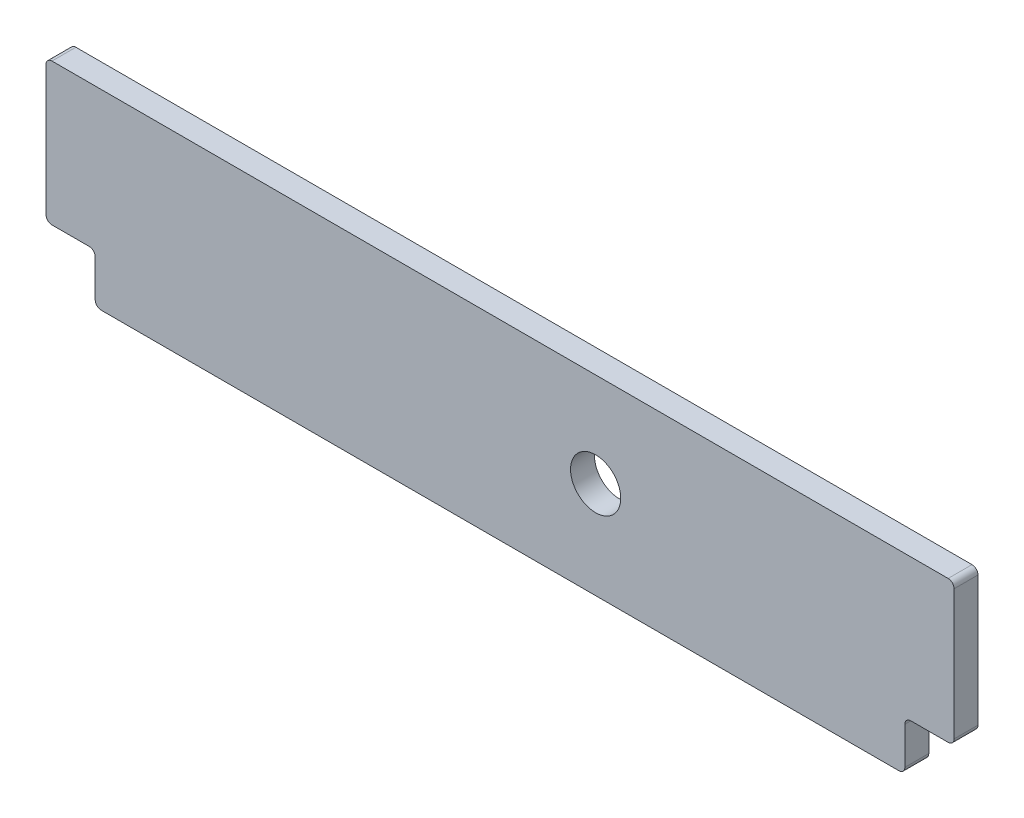
ISO-10303-21;
HEADER;
FILE_DESCRIPTION(('STEP AP214'),'2;1');
FILE_NAME('part.step','',(''),(''),'','','');
FILE_SCHEMA(('AUTOMOTIVE_DESIGN { 1 0 10303 214 1 1 1 1 }'));
ENDSEC;
DATA;
#1=APPLICATION_CONTEXT('core data for automotive mechanical design processes');
#2=APPLICATION_PROTOCOL_DEFINITION('international standard','automotive_design',2000,#1);
#3=PRODUCT_CONTEXT('',#1,'mechanical');
#4=PRODUCT('Part','Part','',(#3));
#5=PRODUCT_RELATED_PRODUCT_CATEGORY('part','',(#4));
#6=PRODUCT_DEFINITION_FORMATION('','',#4);
#7=PRODUCT_DEFINITION_CONTEXT('part definition',#1,'design');
#8=PRODUCT_DEFINITION('design','',#6,#7);
#9=PRODUCT_DEFINITION_SHAPE('','',#8);
#10=(LENGTH_UNIT() NAMED_UNIT(*) SI_UNIT(.MILLI.,.METRE.));
#11=(NAMED_UNIT(*) PLANE_ANGLE_UNIT() SI_UNIT($,.RADIAN.));
#12=(NAMED_UNIT(*) SI_UNIT($,.STERADIAN.) SOLID_ANGLE_UNIT());
#13=UNCERTAINTY_MEASURE_WITH_UNIT(LENGTH_MEASURE(1.E-05),#10,'distance_accuracy_value','');
#14=(GEOMETRIC_REPRESENTATION_CONTEXT(3) GLOBAL_UNCERTAINTY_ASSIGNED_CONTEXT((#13)) GLOBAL_UNIT_ASSIGNED_CONTEXT((#10,
#11,#12)) REPRESENTATION_CONTEXT('',''));
#15=CARTESIAN_POINT('',(0.,0.,0.));
#16=DIRECTION('',(0.,0.,1.));
#17=DIRECTION('',(1.,0.,0.));
#18=AXIS2_PLACEMENT_3D('',#15,#16,#17);
#19=CARTESIAN_POINT('',(215.138,0.,6.35));
#20=DIRECTION('',(-1.,0.,0.));
#21=DIRECTION('',(0.,-1.,0.));
#22=AXIS2_PLACEMENT_3D('',#19,#20,#21);
#23=PLANE('',#22);
#24=DIRECTION('',(0.,1.,0.));
#25=VECTOR('',#24,1.);
#26=CARTESIAN_POINT('',(215.138,2.35089725464378E-13,6.35));
#27=LINE('',#26,#25);
#28=CARTESIAN_POINT('',(215.138,3.17500000000005,6.35));
#29=VERTEX_POINT('',#28);
#30=CARTESIAN_POINT('',(215.138,22.9869999999999,6.35));
#31=VERTEX_POINT('',#30);
#32=EDGE_CURVE('E181',#29,#31,#27,.T.);
#33=ORIENTED_EDGE('',*,*,#32,.F.);
#34=DIRECTION('',(0.,0.,-1.));
#35=VECTOR('',#34,1.);
#36=CARTESIAN_POINT('',(215.138,3.17500000000005,6.35));
#37=LINE('',#36,#35);
#38=CARTESIAN_POINT('',(215.138,3.17500000000005,-6.35));
#39=VERTEX_POINT('',#38);
#40=EDGE_CURVE('E165',#29,#39,#37,.T.);
#41=ORIENTED_EDGE('',*,*,#40,.T.);
#42=DIRECTION('',(0.,1.,0.));
#43=VECTOR('',#42,1.);
#44=CARTESIAN_POINT('',(215.138,2.35089725464378E-13,-6.35));
#45=LINE('',#44,#43);
#46=CARTESIAN_POINT('',(215.138,22.9869999999999,-6.35));
#47=VERTEX_POINT('',#46);
#48=EDGE_CURVE('E178',#39,#47,#45,.T.);
#49=ORIENTED_EDGE('',*,*,#48,.T.);
#50=DIRECTION('',(0.,0.,-1.));
#51=VECTOR('',#50,1.);
#52=CARTESIAN_POINT('',(215.138,22.9869999999999,6.35));
#53=LINE('',#52,#51);
#54=EDGE_CURVE('E184',#47,#31,#53,.F.);
#55=ORIENTED_EDGE('',*,*,#54,.T.);
#56=EDGE_LOOP('',(#33,#41,#49,#55));
#57=FACE_BOUND('',#56,.T.);
#58=ADVANCED_FACE('F44',(#57),#23,.F.);
#59=CARTESIAN_POINT('',(215.9,26.1619999999999,6.35));
#60=DIRECTION('',(0.,1.,0.));
#61=DIRECTION('',(-1.,0.,0.));
#62=AXIS2_PLACEMENT_3D('',#59,#60,#61);
#63=PLANE('',#62);
#64=DIRECTION('',(1.,0.,0.));
#65=VECTOR('',#64,1.);
#66=CARTESIAN_POINT('',(0.,26.162,-6.35));
#67=LINE('',#66,#65);
#68=CARTESIAN_POINT('',(218.313,26.1619999999999,-6.35));
#69=VERTEX_POINT('',#68);
#70=CARTESIAN_POINT('',(238.125,26.1619999999999,-6.35));
#71=VERTEX_POINT('',#70);
#72=EDGE_CURVE('E189',#69,#71,#67,.T.);
#73=ORIENTED_EDGE('',*,*,#72,.T.);
#74=DIRECTION('',(0.,0.,-1.));
#75=VECTOR('',#74,1.);
#76=CARTESIAN_POINT('',(238.125,26.1619999999999,6.35));
#77=LINE('',#76,#75);
#78=CARTESIAN_POINT('',(238.125,26.1619999999999,6.35));
#79=VERTEX_POINT('',#78);
#80=EDGE_CURVE('E283',#71,#79,#77,.F.);
#81=ORIENTED_EDGE('',*,*,#80,.T.);
#82=DIRECTION('',(1.,0.,0.));
#83=VECTOR('',#82,1.);
#84=CARTESIAN_POINT('',(0.,26.162,6.35));
#85=LINE('',#84,#83);
#86=CARTESIAN_POINT('',(218.313,26.1619999999999,6.35));
#87=VERTEX_POINT('',#86);
#88=EDGE_CURVE('E201',#87,#79,#85,.T.);
#89=ORIENTED_EDGE('',*,*,#88,.F.);
#90=DIRECTION('',(0.,0.,-1.));
#91=VECTOR('',#90,1.);
#92=CARTESIAN_POINT('',(218.313,26.1619999999999,-6.35));
#93=LINE('',#92,#91);
#94=EDGE_CURVE('E279',#87,#69,#93,.T.);
#95=ORIENTED_EDGE('',*,*,#94,.T.);
#96=EDGE_LOOP('',(#73,#81,#89,#95));
#97=FACE_BOUND('',#96,.T.);
#98=ADVANCED_FACE('F389',(#97),#63,.F.);
#99=CARTESIAN_POINT('',(241.3,101.6,6.35));
#100=DIRECTION('',(-1.,0.,0.));
#101=DIRECTION('',(0.,-1.,0.));
#102=AXIS2_PLACEMENT_3D('',#99,#100,#101);
#103=PLANE('',#102);
#104=DIRECTION('',(0.,1.,0.));
#105=VECTOR('',#104,1.);
#106=CARTESIAN_POINT('',(241.3,101.6,-6.35));
#107=LINE('',#106,#105);
#108=CARTESIAN_POINT('',(241.3,29.3369999999999,-6.35));
#109=VERTEX_POINT('',#108);
#110=CARTESIAN_POINT('',(241.3,98.4249999999999,-6.35));
#111=VERTEX_POINT('',#110);
#112=EDGE_CURVE('E193',#109,#111,#107,.T.);
#113=ORIENTED_EDGE('',*,*,#112,.T.);
#114=DIRECTION('',(0.,0.,-1.));
#115=VECTOR('',#114,1.);
#116=CARTESIAN_POINT('',(241.3,98.4249999999999,6.35));
#117=LINE('',#116,#115);
#118=CARTESIAN_POINT('',(241.3,98.4249999999999,6.35));
#119=VERTEX_POINT('',#118);
#120=EDGE_CURVE('E276',#111,#119,#117,.F.);
#121=ORIENTED_EDGE('',*,*,#120,.T.);
#122=DIRECTION('',(0.,1.,0.));
#123=VECTOR('',#122,1.);
#124=CARTESIAN_POINT('',(241.3,101.6,6.35));
#125=LINE('',#124,#123);
#126=CARTESIAN_POINT('',(241.3,29.3369999999999,6.35));
#127=VERTEX_POINT('',#126);
#128=EDGE_CURVE('E205',#127,#119,#125,.T.);
#129=ORIENTED_EDGE('',*,*,#128,.F.);
#130=DIRECTION('',(0.,0.,-1.));
#131=VECTOR('',#130,1.);
#132=CARTESIAN_POINT('',(241.3,29.3369999999999,6.35));
#133=LINE('',#132,#131);
#134=EDGE_CURVE('E272',#127,#109,#133,.T.);
#135=ORIENTED_EDGE('',*,*,#134,.T.);
#136=EDGE_LOOP('',(#113,#121,#129,#135));
#137=FACE_BOUND('',#136,.T.);
#138=ADVANCED_FACE('F357',(#137),#103,.F.);
#139=CARTESIAN_POINT('',(-241.3,101.6,6.35));
#140=DIRECTION('',(0.,-1.,0.));
#141=DIRECTION('',(1.,0.,0.));
#142=AXIS2_PLACEMENT_3D('',#139,#140,#141);
#143=PLANE('',#142);
#144=DIRECTION('',(-1.,0.,0.));
#145=VECTOR('',#144,1.);
#146=CARTESIAN_POINT('',(-241.3,101.6,-6.35));
#147=LINE('',#146,#145);
#148=CARTESIAN_POINT('',(238.125,101.6,-6.35));
#149=VERTEX_POINT('',#148);
#150=CARTESIAN_POINT('',(-238.125,101.6,-6.35));
#151=VERTEX_POINT('',#150);
#152=EDGE_CURVE('E346',#149,#151,#147,.T.);
#153=ORIENTED_EDGE('',*,*,#152,.T.);
#154=DIRECTION('',(0.,0.,-1.));
#155=VECTOR('',#154,1.);
#156=CARTESIAN_POINT('',(-238.125,101.6,6.35));
#157=LINE('',#156,#155);
#158=CARTESIAN_POINT('',(-238.125,101.6,6.35));
#159=VERTEX_POINT('',#158);
#160=EDGE_CURVE('E269',#151,#159,#157,.F.);
#161=ORIENTED_EDGE('',*,*,#160,.T.);
#162=DIRECTION('',(-1.,0.,0.));
#163=VECTOR('',#162,1.);
#164=CARTESIAN_POINT('',(-241.3,101.6,6.35));
#165=LINE('',#164,#163);
#166=CARTESIAN_POINT('',(238.125,101.6,6.35));
#167=VERTEX_POINT('',#166);
#168=EDGE_CURVE('E314',#167,#159,#165,.T.);
#169=ORIENTED_EDGE('',*,*,#168,.F.);
#170=DIRECTION('',(0.,0.,-1.));
#171=VECTOR('',#170,1.);
#172=CARTESIAN_POINT('',(238.125,101.6,6.35));
#173=LINE('',#172,#171);
#174=EDGE_CURVE('E265',#167,#149,#173,.T.);
#175=ORIENTED_EDGE('',*,*,#174,.T.);
#176=EDGE_LOOP('',(#153,#161,#169,#175));
#177=FACE_BOUND('',#176,.T.);
#178=ADVANCED_FACE('F366',(#177),#143,.F.);
#179=CARTESIAN_POINT('',(-241.3,101.6,6.35));
#180=DIRECTION('',(1.,0.,0.));
#181=DIRECTION('',(0.,0.,-1.));
#182=AXIS2_PLACEMENT_3D('',#179,#180,#181);
#183=PLANE('',#182);
#184=DIRECTION('',(0.,-1.,0.));
#185=VECTOR('',#184,1.);
#186=CARTESIAN_POINT('',(-241.3,101.6,6.35));
#187=LINE('',#186,#185);
#188=CARTESIAN_POINT('',(-241.3,98.4250000000001,6.35));
#189=VERTEX_POINT('',#188);
#190=CARTESIAN_POINT('',(-241.3,29.3370000000001,6.35));
#191=VERTEX_POINT('',#190);
#192=EDGE_CURVE('E310',#189,#191,#187,.T.);
#193=ORIENTED_EDGE('',*,*,#192,.F.);
#194=DIRECTION('',(0.,0.,-1.));
#195=VECTOR('',#194,1.);
#196=CARTESIAN_POINT('',(-241.3,98.4250000000001,6.35));
#197=LINE('',#196,#195);
#198=CARTESIAN_POINT('',(-241.3,98.4250000000001,-6.35));
#199=VERTEX_POINT('',#198);
#200=EDGE_CURVE('E261',#189,#199,#197,.T.);
#201=ORIENTED_EDGE('',*,*,#200,.T.);
#202=DIRECTION('',(0.,-1.,0.));
#203=VECTOR('',#202,1.);
#204=CARTESIAN_POINT('',(-241.3,101.6,-6.35));
#205=LINE('',#204,#203);
#206=CARTESIAN_POINT('',(-241.3,29.3370000000001,-6.35));
#207=VERTEX_POINT('',#206);
#208=EDGE_CURVE('E325',#199,#207,#205,.T.);
#209=ORIENTED_EDGE('',*,*,#208,.T.);
#210=DIRECTION('',(0.,0.,-1.));
#211=VECTOR('',#210,1.);
#212=CARTESIAN_POINT('',(-241.3,29.337,6.35));
#213=LINE('',#212,#211);
#214=EDGE_CURVE('E258',#207,#191,#213,.F.);
#215=ORIENTED_EDGE('',*,*,#214,.T.);
#216=EDGE_LOOP('',(#193,#201,#209,#215));
#217=FACE_BOUND('',#216,.T.);
#218=ADVANCED_FACE('F372',(#217),#183,.F.);
#219=CARTESIAN_POINT('',(-215.9,26.162,6.35));
#220=DIRECTION('',(0.,1.,0.));
#221=DIRECTION('',(0.,0.,1.));
#222=AXIS2_PLACEMENT_3D('',#219,#220,#221);
#223=PLANE('',#222);
#224=DIRECTION('',(1.,0.,0.));
#225=VECTOR('',#224,1.);
#226=CARTESIAN_POINT('',(0.,26.162,-6.35));
#227=LINE('',#226,#225);
#228=CARTESIAN_POINT('',(-238.125,26.162,-6.35));
#229=VERTEX_POINT('',#228);
#230=CARTESIAN_POINT('',(-218.313,26.162,-6.35));
#231=VERTEX_POINT('',#230);
#232=EDGE_CURVE('E321',#229,#231,#227,.T.);
#233=ORIENTED_EDGE('',*,*,#232,.T.);
#234=DIRECTION('',(0.,0.,-1.));
#235=VECTOR('',#234,1.);
#236=CARTESIAN_POINT('',(-218.313,26.162,6.35));
#237=LINE('',#236,#235);
#238=CARTESIAN_POINT('',(-218.313,26.162,6.35));
#239=VERTEX_POINT('',#238);
#240=EDGE_CURVE('E255',#231,#239,#237,.F.);
#241=ORIENTED_EDGE('',*,*,#240,.T.);
#242=DIRECTION('',(1.,0.,0.));
#243=VECTOR('',#242,1.);
#244=CARTESIAN_POINT('',(0.,26.162,6.35));
#245=LINE('',#244,#243);
#246=CARTESIAN_POINT('',(-238.125,26.162,6.35));
#247=VERTEX_POINT('',#246);
#248=EDGE_CURVE('E306',#247,#239,#245,.T.);
#249=ORIENTED_EDGE('',*,*,#248,.F.);
#250=DIRECTION('',(0.,0.,-1.));
#251=VECTOR('',#250,1.);
#252=CARTESIAN_POINT('',(-238.125,26.162,6.35));
#253=LINE('',#252,#251);
#254=EDGE_CURVE('E251',#247,#229,#253,.T.);
#255=ORIENTED_EDGE('',*,*,#254,.T.);
#256=EDGE_LOOP('',(#233,#241,#249,#255));
#257=FACE_BOUND('',#256,.T.);
#258=ADVANCED_FACE('F377',(#257),#223,.F.);
#259=CARTESIAN_POINT('',(-215.138,25.4,6.35));
#260=DIRECTION('',(1.,0.,0.));
#261=DIRECTION('',(0.,0.,-1.));
#262=AXIS2_PLACEMENT_3D('',#259,#260,#261);
#263=PLANE('',#262);
#264=DIRECTION('',(0.,-1.,0.));
#265=VECTOR('',#264,1.);
#266=CARTESIAN_POINT('',(-215.138,0.,-6.35));
#267=LINE('',#266,#265);
#268=CARTESIAN_POINT('',(-215.138,22.987,-6.35));
#269=VERTEX_POINT('',#268);
#270=CARTESIAN_POINT('',(-215.138,3.17500000000004,-6.35));
#271=VERTEX_POINT('',#270);
#272=EDGE_CURVE('E197',#269,#271,#267,.T.);
#273=ORIENTED_EDGE('',*,*,#272,.T.);
#274=DIRECTION('',(0.,0.,-1.));
#275=VECTOR('',#274,1.);
#276=CARTESIAN_POINT('',(-215.138,3.17500000000004,6.35));
#277=LINE('',#276,#275);
#278=CARTESIAN_POINT('',(-215.138,3.17500000000004,6.35));
#279=VERTEX_POINT('',#278);
#280=EDGE_CURVE('E62',#271,#279,#277,.F.);
#281=ORIENTED_EDGE('',*,*,#280,.T.);
#282=DIRECTION('',(0.,-1.,0.));
#283=VECTOR('',#282,1.);
#284=CARTESIAN_POINT('',(-215.138,0.,6.35));
#285=LINE('',#284,#283);
#286=CARTESIAN_POINT('',(-215.138,22.987,6.35));
#287=VERTEX_POINT('',#286);
#288=EDGE_CURVE('E302',#287,#279,#285,.T.);
#289=ORIENTED_EDGE('',*,*,#288,.F.);
#290=DIRECTION('',(0.,0.,-1.));
#291=VECTOR('',#290,1.);
#292=CARTESIAN_POINT('',(-215.138,22.987,-6.35));
#293=LINE('',#292,#291);
#294=EDGE_CURVE('E245',#287,#269,#293,.T.);
#295=ORIENTED_EDGE('',*,*,#294,.T.);
#296=EDGE_LOOP('',(#273,#281,#289,#295));
#297=FACE_BOUND('',#296,.T.);
#298=ADVANCED_FACE('F337',(#297),#263,.F.);
#299=CARTESIAN_POINT('',(-215.9,0.,6.35));
#300=DIRECTION('',(0.,1.,0.));
#301=DIRECTION('',(0.,0.,1.));
#302=AXIS2_PLACEMENT_3D('',#299,#300,#301);
#303=PLANE('',#302);
#304=DIRECTION('',(1.,0.,0.));
#305=VECTOR('',#304,1.);
#306=CARTESIAN_POINT('',(-215.9,0.,-6.35));
#307=LINE('',#306,#305);
#308=CARTESIAN_POINT('',(-211.963,0.,-6.35));
#309=VERTEX_POINT('',#308);
#310=CARTESIAN_POINT('',(211.963,0.,-6.35));
#311=VERTEX_POINT('',#310);
#312=EDGE_CURVE('E202',#309,#311,#307,.T.);
#313=ORIENTED_EDGE('',*,*,#312,.T.);
#314=DIRECTION('',(0.,0.,-1.));
#315=VECTOR('',#314,1.);
#316=CARTESIAN_POINT('',(211.963,0.,6.35));
#317=LINE('',#316,#315);
#318=CARTESIAN_POINT('',(211.963,0.,6.35));
#319=VERTEX_POINT('',#318);
#320=EDGE_CURVE('E166',#311,#319,#317,.F.);
#321=ORIENTED_EDGE('',*,*,#320,.T.);
#322=DIRECTION('',(1.,0.,0.));
#323=VECTOR('',#322,1.);
#324=CARTESIAN_POINT('',(-215.9,0.,6.35));
#325=LINE('',#324,#323);
#326=CARTESIAN_POINT('',(-211.963,0.,6.35));
#327=VERTEX_POINT('',#326);
#328=EDGE_CURVE('E295',#327,#319,#325,.T.);
#329=ORIENTED_EDGE('',*,*,#328,.F.);
#330=DIRECTION('',(0.,0.,-1.));
#331=VECTOR('',#330,1.);
#332=CARTESIAN_POINT('',(-211.963,0.,6.35));
#333=LINE('',#332,#331);
#334=EDGE_CURVE('E172',#327,#309,#333,.T.);
#335=ORIENTED_EDGE('',*,*,#334,.T.);
#336=EDGE_LOOP('',(#313,#321,#329,#335));
#337=FACE_BOUND('',#336,.T.);
#338=ADVANCED_FACE('F384',(#337),#303,.F.);
#339=CARTESIAN_POINT('',(0.,0.,6.35));
#340=DIRECTION('',(0.,0.,-1.));
#341=DIRECTION('',(-1.,0.,0.));
#342=AXIS2_PLACEMENT_3D('',#339,#340,#341);
#343=PLANE('',#342);
#344=CARTESIAN_POINT('',(50.8000000000006,51.5000000000016,6.34999999999999));
#345=DIRECTION('',(0.,0.,-1.));
#346=DIRECTION('',(-1.,0.,0.));
#347=AXIS2_PLACEMENT_3D('',#344,#345,#346);
#348=CIRCLE('',#347,13.3350000000001);
#349=CARTESIAN_POINT('',(37.4650000000005,51.5000000000016,6.34999999999999));
#350=VERTEX_POINT('',#349);
#351=EDGE_CURVE('E48',#350,#350,#348,.F.);
#352=ORIENTED_EDGE('',*,*,#351,.F.);
#353=EDGE_LOOP('',(#352));
#354=FACE_BOUND('',#353,.T.);
#355=ORIENTED_EDGE('',*,*,#328,.T.);
#356=CARTESIAN_POINT('',(211.963,3.17500000000004,6.35));
#357=DIRECTION('',(0.,0.,-1.));
#358=DIRECTION('',(-1.,0.,0.));
#359=AXIS2_PLACEMENT_3D('',#356,#357,#358);
#360=CIRCLE('',#359,3.175);
#361=EDGE_CURVE('E242',#319,#29,#360,.F.);
#362=ORIENTED_EDGE('',*,*,#361,.T.);
#363=ORIENTED_EDGE('',*,*,#32,.T.);
#364=CARTESIAN_POINT('',(218.313,22.9869999999999,6.35));
#365=DIRECTION('',(0.,0.,-1.));
#366=DIRECTION('',(-1.,0.,0.));
#367=AXIS2_PLACEMENT_3D('',#364,#365,#366);
#368=CIRCLE('',#367,3.175);
#369=EDGE_CURVE('E12',#31,#87,#368,.T.);
#370=ORIENTED_EDGE('',*,*,#369,.T.);
#371=ORIENTED_EDGE('',*,*,#88,.T.);
#372=CARTESIAN_POINT('',(238.125,29.3369999999999,6.35));
#373=DIRECTION('',(0.,0.,-1.));
#374=DIRECTION('',(-1.,0.,0.));
#375=AXIS2_PLACEMENT_3D('',#372,#373,#374);
#376=CIRCLE('',#375,3.175);
#377=EDGE_CURVE('E230',#79,#127,#376,.F.);
#378=ORIENTED_EDGE('',*,*,#377,.T.);
#379=ORIENTED_EDGE('',*,*,#128,.T.);
#380=CARTESIAN_POINT('',(238.125,98.4249999999999,6.35));
#381=DIRECTION('',(0.,0.,-1.));
#382=DIRECTION('',(-1.,0.,0.));
#383=AXIS2_PLACEMENT_3D('',#380,#381,#382);
#384=CIRCLE('',#383,3.175);
#385=EDGE_CURVE('E233',#119,#167,#384,.F.);
#386=ORIENTED_EDGE('',*,*,#385,.T.);
#387=ORIENTED_EDGE('',*,*,#168,.T.);
#388=CARTESIAN_POINT('',(-238.125,98.4250000000001,6.35));
#389=DIRECTION('',(0.,0.,-1.));
#390=DIRECTION('',(-1.,0.,0.));
#391=AXIS2_PLACEMENT_3D('',#388,#389,#390);
#392=CIRCLE('',#391,3.175);
#393=EDGE_CURVE('E236',#159,#189,#392,.F.);
#394=ORIENTED_EDGE('',*,*,#393,.T.);
#395=ORIENTED_EDGE('',*,*,#192,.T.);
#396=CARTESIAN_POINT('',(-238.125,29.337,6.35));
#397=DIRECTION('',(0.,0.,-1.));
#398=DIRECTION('',(-1.,0.,0.));
#399=AXIS2_PLACEMENT_3D('',#396,#397,#398);
#400=CIRCLE('',#399,3.175);
#401=EDGE_CURVE('E227',#191,#247,#400,.F.);
#402=ORIENTED_EDGE('',*,*,#401,.T.);
#403=ORIENTED_EDGE('',*,*,#248,.T.);
#404=CARTESIAN_POINT('',(-218.313,22.987,6.35));
#405=DIRECTION('',(0.,0.,-1.));
#406=DIRECTION('',(-1.,0.,0.));
#407=AXIS2_PLACEMENT_3D('',#404,#405,#406);
#408=CIRCLE('',#407,3.175);
#409=EDGE_CURVE('E69',#239,#287,#408,.T.);
#410=ORIENTED_EDGE('',*,*,#409,.T.);
#411=ORIENTED_EDGE('',*,*,#288,.T.);
#412=CARTESIAN_POINT('',(-211.963,3.17500000000004,6.35));
#413=DIRECTION('',(0.,0.,-1.));
#414=DIRECTION('',(-1.,0.,0.));
#415=AXIS2_PLACEMENT_3D('',#412,#413,#414);
#416=CIRCLE('',#415,3.175);
#417=EDGE_CURVE('E239',#279,#327,#416,.F.);
#418=ORIENTED_EDGE('',*,*,#417,.T.);
#419=EDGE_LOOP('',(#355,#362,#363,#370,#371,#378,#379,#386,#387,#394,#395,#402,#403,#410,#411,#418));
#420=FACE_BOUND('',#419,.T.);
#421=ADVANCED_FACE('F328',(#354,#420),#343,.F.);
#422=CARTESIAN_POINT('',(0.,0.,-6.35));
#423=DIRECTION('',(0.,0.,-1.));
#424=DIRECTION('',(-1.,0.,0.));
#425=AXIS2_PLACEMENT_3D('',#422,#423,#424);
#426=PLANE('',#425);
#427=CARTESIAN_POINT('',(50.8000000000006,51.5000000000016,-6.34999999999999));
#428=DIRECTION('',(0.,0.,-1.));
#429=DIRECTION('',(-1.,0.,0.));
#430=AXIS2_PLACEMENT_3D('',#427,#428,#429);
#431=CIRCLE('',#430,13.3350000000001);
#432=CARTESIAN_POINT('',(37.4650000000005,51.5000000000016,-6.34999999999999));
#433=VERTEX_POINT('',#432);
#434=EDGE_CURVE('E292',#433,#433,#431,.F.);
#435=ORIENTED_EDGE('',*,*,#434,.T.);
#436=EDGE_LOOP('',(#435));
#437=FACE_BOUND('',#436,.T.);
#438=ORIENTED_EDGE('',*,*,#48,.F.);
#439=CARTESIAN_POINT('',(211.963,3.17500000000004,-6.35));
#440=DIRECTION('',(0.,0.,-1.));
#441=DIRECTION('',(-1.,0.,0.));
#442=AXIS2_PLACEMENT_3D('',#439,#440,#441);
#443=CIRCLE('',#442,3.175);
#444=EDGE_CURVE('E161',#39,#311,#443,.T.);
#445=ORIENTED_EDGE('',*,*,#444,.T.);
#446=ORIENTED_EDGE('',*,*,#312,.F.);
#447=CARTESIAN_POINT('',(-211.963,3.17500000000004,-6.35));
#448=DIRECTION('',(0.,0.,-1.));
#449=DIRECTION('',(-1.,0.,0.));
#450=AXIS2_PLACEMENT_3D('',#447,#448,#449);
#451=CIRCLE('',#450,3.175);
#452=EDGE_CURVE('E173',#309,#271,#451,.T.);
#453=ORIENTED_EDGE('',*,*,#452,.T.);
#454=ORIENTED_EDGE('',*,*,#272,.F.);
#455=CARTESIAN_POINT('',(-218.313,22.987,-6.35));
#456=DIRECTION('',(0.,0.,-1.));
#457=DIRECTION('',(-1.,0.,0.));
#458=AXIS2_PLACEMENT_3D('',#455,#456,#457);
#459=CIRCLE('',#458,3.175);
#460=EDGE_CURVE('E286',#269,#231,#459,.F.);
#461=ORIENTED_EDGE('',*,*,#460,.T.);
#462=ORIENTED_EDGE('',*,*,#232,.F.);
#463=CARTESIAN_POINT('',(-238.125,29.337,-6.35));
#464=DIRECTION('',(0.,0.,-1.));
#465=DIRECTION('',(-1.,0.,0.));
#466=AXIS2_PLACEMENT_3D('',#463,#464,#465);
#467=CIRCLE('',#466,3.175);
#468=EDGE_CURVE('E183',#229,#207,#467,.T.);
#469=ORIENTED_EDGE('',*,*,#468,.T.);
#470=ORIENTED_EDGE('',*,*,#208,.F.);
#471=CARTESIAN_POINT('',(-238.125,98.4250000000001,-6.35));
#472=DIRECTION('',(0.,0.,-1.));
#473=DIRECTION('',(-1.,0.,0.));
#474=AXIS2_PLACEMENT_3D('',#471,#472,#473);
#475=CIRCLE('',#474,3.175);
#476=EDGE_CURVE('E217',#199,#151,#475,.T.);
#477=ORIENTED_EDGE('',*,*,#476,.T.);
#478=ORIENTED_EDGE('',*,*,#152,.F.);
#479=CARTESIAN_POINT('',(238.125,98.4249999999999,-6.35));
#480=DIRECTION('',(0.,0.,-1.));
#481=DIRECTION('',(-1.,0.,0.));
#482=AXIS2_PLACEMENT_3D('',#479,#480,#481);
#483=CIRCLE('',#482,3.175);
#484=EDGE_CURVE('E214',#149,#111,#483,.T.);
#485=ORIENTED_EDGE('',*,*,#484,.T.);
#486=ORIENTED_EDGE('',*,*,#112,.F.);
#487=CARTESIAN_POINT('',(238.125,29.3369999999999,-6.35));
#488=DIRECTION('',(0.,0.,-1.));
#489=DIRECTION('',(-1.,0.,0.));
#490=AXIS2_PLACEMENT_3D('',#487,#488,#489);
#491=CIRCLE('',#490,3.175);
#492=EDGE_CURVE('E211',#109,#71,#491,.T.);
#493=ORIENTED_EDGE('',*,*,#492,.T.);
#494=ORIENTED_EDGE('',*,*,#72,.F.);
#495=CARTESIAN_POINT('',(218.313,22.9869999999999,-6.35));
#496=DIRECTION('',(0.,0.,-1.));
#497=DIRECTION('',(-1.,0.,0.));
#498=AXIS2_PLACEMENT_3D('',#495,#496,#497);
#499=CIRCLE('',#498,3.175);
#500=EDGE_CURVE('E54',#69,#47,#499,.F.);
#501=ORIENTED_EDGE('',*,*,#500,.T.);
#502=EDGE_LOOP('',(#438,#445,#446,#453,#454,#461,#462,#469,#470,#477,#478,#485,#486,#493,#494,#501));
#503=FACE_BOUND('',#502,.T.);
#504=ADVANCED_FACE('F186',(#437,#503),#426,.T.);
#505=CARTESIAN_POINT('',(50.8000000000006,51.5000000000017,-101.056542434233));
#506=DIRECTION('',(0.,0.,1.));
#507=DIRECTION('',(0.,-1.,0.));
#508=AXIS2_PLACEMENT_3D('',#505,#506,#507);
#509=CYLINDRICAL_SURFACE('',#508,13.3350000000001);
#510=ORIENTED_EDGE('',*,*,#434,.F.);
#511=EDGE_LOOP('',(#510));
#512=FACE_BOUND('',#511,.T.);
#513=ORIENTED_EDGE('',*,*,#351,.T.);
#514=EDGE_LOOP('',(#513));
#515=FACE_BOUND('',#514,.T.);
#516=ADVANCED_FACE('F46',(#512,#515),#509,.F.);
#517=CARTESIAN_POINT('',(211.963,3.17500000000004,6.35));
#518=DIRECTION('',(0.,0.,-1.));
#519=DIRECTION('',(-1.,0.,0.));
#520=AXIS2_PLACEMENT_3D('',#517,#518,#519);
#521=CYLINDRICAL_SURFACE('',#520,3.175);
#522=ORIENTED_EDGE('',*,*,#361,.F.);
#523=ORIENTED_EDGE('',*,*,#320,.F.);
#524=ORIENTED_EDGE('',*,*,#444,.F.);
#525=ORIENTED_EDGE('',*,*,#40,.F.);
#526=EDGE_LOOP('',(#522,#523,#524,#525));
#527=FACE_BOUND('',#526,.T.);
#528=ADVANCED_FACE('F164',(#527),#521,.T.);
#529=CARTESIAN_POINT('',(-211.963,3.17500000000004,6.35));
#530=DIRECTION('',(0.,0.,-1.));
#531=DIRECTION('',(-1.,0.,0.));
#532=AXIS2_PLACEMENT_3D('',#529,#530,#531);
#533=CYLINDRICAL_SURFACE('',#532,3.175);
#534=ORIENTED_EDGE('',*,*,#417,.F.);
#535=ORIENTED_EDGE('',*,*,#280,.F.);
#536=ORIENTED_EDGE('',*,*,#452,.F.);
#537=ORIENTED_EDGE('',*,*,#334,.F.);
#538=EDGE_LOOP('',(#534,#535,#536,#537));
#539=FACE_BOUND('',#538,.T.);
#540=ADVANCED_FACE('F399',(#539),#533,.T.);
#541=CARTESIAN_POINT('',(-218.313,22.987,6.35));
#542=DIRECTION('',(0.,0.,1.));
#543=DIRECTION('',(1.,0.,0.));
#544=AXIS2_PLACEMENT_3D('',#541,#542,#543);
#545=CYLINDRICAL_SURFACE('',#544,3.175);
#546=ORIENTED_EDGE('',*,*,#409,.F.);
#547=ORIENTED_EDGE('',*,*,#240,.F.);
#548=ORIENTED_EDGE('',*,*,#460,.F.);
#549=ORIENTED_EDGE('',*,*,#294,.F.);
#550=EDGE_LOOP('',(#546,#547,#548,#549));
#551=FACE_BOUND('',#550,.T.);
#552=ADVANCED_FACE('F335',(#551),#545,.F.);
#553=CARTESIAN_POINT('',(-238.125,98.4250000000001,6.35));
#554=DIRECTION('',(0.,0.,-1.));
#555=DIRECTION('',(-1.,0.,0.));
#556=AXIS2_PLACEMENT_3D('',#553,#554,#555);
#557=CYLINDRICAL_SURFACE('',#556,3.175);
#558=ORIENTED_EDGE('',*,*,#393,.F.);
#559=ORIENTED_EDGE('',*,*,#160,.F.);
#560=ORIENTED_EDGE('',*,*,#476,.F.);
#561=ORIENTED_EDGE('',*,*,#200,.F.);
#562=EDGE_LOOP('',(#558,#559,#560,#561));
#563=FACE_BOUND('',#562,.T.);
#564=ADVANCED_FACE('F368',(#563),#557,.T.);
#565=CARTESIAN_POINT('',(238.125,98.4249999999999,6.35));
#566=DIRECTION('',(0.,0.,-1.));
#567=DIRECTION('',(-1.,0.,0.));
#568=AXIS2_PLACEMENT_3D('',#565,#566,#567);
#569=CYLINDRICAL_SURFACE('',#568,3.175);
#570=ORIENTED_EDGE('',*,*,#385,.F.);
#571=ORIENTED_EDGE('',*,*,#120,.F.);
#572=ORIENTED_EDGE('',*,*,#484,.F.);
#573=ORIENTED_EDGE('',*,*,#174,.F.);
#574=EDGE_LOOP('',(#570,#571,#572,#573));
#575=FACE_BOUND('',#574,.T.);
#576=ADVANCED_FACE('F362',(#575),#569,.T.);
#577=CARTESIAN_POINT('',(238.125,29.3369999999999,6.35));
#578=DIRECTION('',(0.,0.,-1.));
#579=DIRECTION('',(-1.,0.,0.));
#580=AXIS2_PLACEMENT_3D('',#577,#578,#579);
#581=CYLINDRICAL_SURFACE('',#580,3.175);
#582=ORIENTED_EDGE('',*,*,#377,.F.);
#583=ORIENTED_EDGE('',*,*,#80,.F.);
#584=ORIENTED_EDGE('',*,*,#492,.F.);
#585=ORIENTED_EDGE('',*,*,#134,.F.);
#586=EDGE_LOOP('',(#582,#583,#584,#585));
#587=FACE_BOUND('',#586,.T.);
#588=ADVANCED_FACE('F409',(#587),#581,.T.);
#589=CARTESIAN_POINT('',(218.313,22.9869999999999,6.35));
#590=DIRECTION('',(0.,0.,1.));
#591=DIRECTION('',(1.,0.,0.));
#592=AXIS2_PLACEMENT_3D('',#589,#590,#591);
#593=CYLINDRICAL_SURFACE('',#592,3.175);
#594=ORIENTED_EDGE('',*,*,#369,.F.);
#595=ORIENTED_EDGE('',*,*,#54,.F.);
#596=ORIENTED_EDGE('',*,*,#500,.F.);
#597=ORIENTED_EDGE('',*,*,#94,.F.);
#598=EDGE_LOOP('',(#594,#595,#596,#597));
#599=FACE_BOUND('',#598,.T.);
#600=ADVANCED_FACE('F412',(#599),#593,.F.);
#601=CARTESIAN_POINT('',(-238.125,29.337,6.35));
#602=DIRECTION('',(0.,0.,-1.));
#603=DIRECTION('',(-1.,0.,0.));
#604=AXIS2_PLACEMENT_3D('',#601,#602,#603);
#605=CYLINDRICAL_SURFACE('',#604,3.175);
#606=ORIENTED_EDGE('',*,*,#401,.F.);
#607=ORIENTED_EDGE('',*,*,#214,.F.);
#608=ORIENTED_EDGE('',*,*,#468,.F.);
#609=ORIENTED_EDGE('',*,*,#254,.F.);
#610=EDGE_LOOP('',(#606,#607,#608,#609));
#611=FACE_BOUND('',#610,.T.);
#612=ADVANCED_FACE('F376',(#611),#605,.T.);
#613=CLOSED_SHELL('',(#58,#98,#138,#178,#218,#258,#298,#338,#421,#504,#516,#528,#540,#552,#564,
#576,#588,#600,#612));
#614=MANIFOLD_SOLID_BREP('B2',#613);
#615=ADVANCED_BREP_SHAPE_REPRESENTATION('',(#18,#614),#14);
#616=SHAPE_DEFINITION_REPRESENTATION(#9,#615);
ENDSEC;
END-ISO-10303-21;
